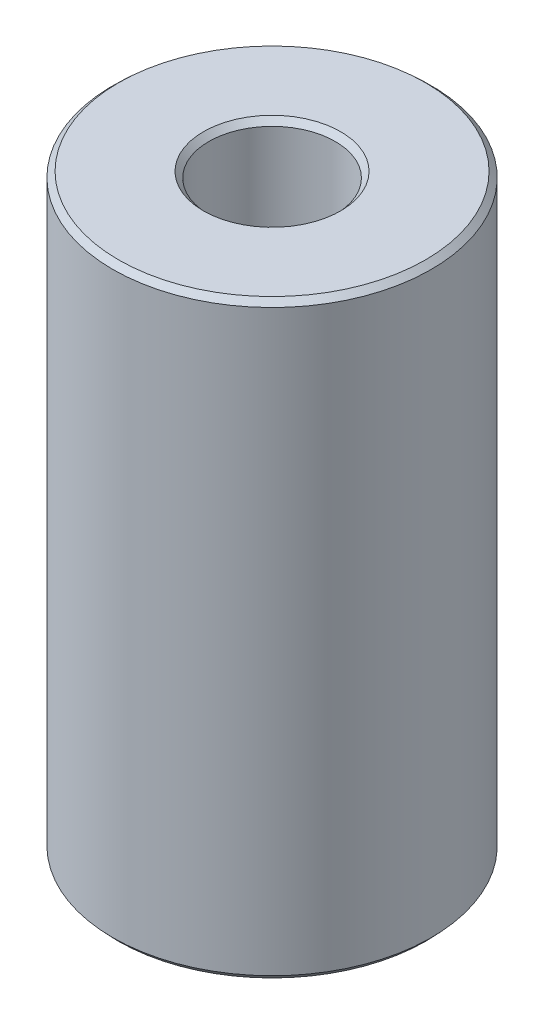
ISO-10303-21;
HEADER;
FILE_DESCRIPTION(('STEP AP214'),'2;1');
FILE_NAME('part.step','',(''),(''),'','','');
FILE_SCHEMA(('AUTOMOTIVE_DESIGN { 1 0 10303 214 1 1 1 1 }'));
ENDSEC;
DATA;
#1=APPLICATION_CONTEXT('core data for automotive mechanical design processes');
#2=APPLICATION_PROTOCOL_DEFINITION('international standard','automotive_design',2000,#1);
#3=PRODUCT_CONTEXT('',#1,'mechanical');
#4=PRODUCT('Part','Part','',(#3));
#5=PRODUCT_RELATED_PRODUCT_CATEGORY('part','',(#4));
#6=PRODUCT_DEFINITION_FORMATION('','',#4);
#7=PRODUCT_DEFINITION_CONTEXT('part definition',#1,'design');
#8=PRODUCT_DEFINITION('design','',#6,#7);
#9=PRODUCT_DEFINITION_SHAPE('','',#8);
#10=(LENGTH_UNIT() NAMED_UNIT(*) SI_UNIT(.MILLI.,.METRE.));
#11=(NAMED_UNIT(*) PLANE_ANGLE_UNIT() SI_UNIT($,.RADIAN.));
#12=(NAMED_UNIT(*) SI_UNIT($,.STERADIAN.) SOLID_ANGLE_UNIT());
#13=UNCERTAINTY_MEASURE_WITH_UNIT(LENGTH_MEASURE(1.E-05),#10,'distance_accuracy_value','');
#14=(GEOMETRIC_REPRESENTATION_CONTEXT(3) GLOBAL_UNCERTAINTY_ASSIGNED_CONTEXT((#13)) GLOBAL_UNIT_ASSIGNED_CONTEXT((#10,
#11,#12)) REPRESENTATION_CONTEXT('',''));
#15=CARTESIAN_POINT('',(0.,0.,0.));
#16=DIRECTION('',(0.,0.,1.));
#17=DIRECTION('',(1.,0.,0.));
#18=AXIS2_PLACEMENT_3D('',#15,#16,#17);
#19=CARTESIAN_POINT('',(0.,55.5727695156679,0.));
#20=DIRECTION('',(0.,-1.,0.));
#21=DIRECTION('',(0.,0.,-1.));
#22=AXIS2_PLACEMENT_3D('',#19,#20,#21);
#23=CYLINDRICAL_SURFACE('',#22,15.);
#24=CARTESIAN_POINT('',(0.,0.543249397855397,0.));
#25=DIRECTION('',(0.,1.,0.));
#26=DIRECTION('',(0.,0.,1.));
#27=AXIS2_PLACEMENT_3D('',#24,#25,#26);
#28=CIRCLE('',#27,15.);
#29=CARTESIAN_POINT('',(0.,0.543249397855397,15.));
#30=VERTEX_POINT('',#29);
#31=EDGE_CURVE('E10',#30,#30,#28,.T.);
#32=ORIENTED_EDGE('',*,*,#31,.T.);
#33=EDGE_LOOP('',(#32));
#34=FACE_BOUND('',#33,.T.);
#35=CARTESIAN_POINT('',(0.,55.0635372144395,0.));
#36=DIRECTION('',(0.,1.,0.));
#37=DIRECTION('',(0.,0.,1.));
#38=AXIS2_PLACEMENT_3D('',#35,#36,#37);
#39=CIRCLE('',#38,15.);
#40=CARTESIAN_POINT('',(0.,55.0635372144395,15.));
#41=VERTEX_POINT('',#40);
#42=EDGE_CURVE('E50',#41,#41,#39,.F.);
#43=ORIENTED_EDGE('',*,*,#42,.T.);
#44=EDGE_LOOP('',(#43));
#45=FACE_BOUND('',#44,.T.);
#46=ADVANCED_FACE('F39',(#34,#45),#23,.T.);
#47=CARTESIAN_POINT('',(0.,55.5727695156679,0.));
#48=DIRECTION('',(0.,1.,0.));
#49=DIRECTION('',(0.,0.,1.));
#50=AXIS2_PLACEMENT_3D('',#47,#48,#49);
#51=PLANE('',#50);
#52=CARTESIAN_POINT('',(0.,55.5727695156679,0.));
#53=DIRECTION('',(0.,1.,0.));
#54=DIRECTION('',(0.,0.,1.));
#55=AXIS2_PLACEMENT_3D('',#52,#53,#54);
#56=CIRCLE('',#55,6.46547847952785);
#57=CARTESIAN_POINT('',(0.,55.5727695156679,6.46547847952785));
#58=VERTEX_POINT('',#57);
#59=EDGE_CURVE('E58',#58,#58,#56,.F.);
#60=ORIENTED_EDGE('',*,*,#59,.T.);
#61=EDGE_LOOP('',(#60));
#62=FACE_BOUND('',#61,.T.);
#63=CARTESIAN_POINT('',(0.,55.5727695156679,0.));
#64=DIRECTION('',(0.,1.,0.));
#65=DIRECTION('',(0.,0.,1.));
#66=AXIS2_PLACEMENT_3D('',#63,#64,#65);
#67=CIRCLE('',#66,14.4567506021446);
#68=CARTESIAN_POINT('',(0.,55.5727695156679,14.4567506021446));
#69=VERTEX_POINT('',#68);
#70=EDGE_CURVE('E61',#69,#69,#67,.T.);
#71=ORIENTED_EDGE('',*,*,#70,.T.);
#72=EDGE_LOOP('',(#71));
#73=FACE_BOUND('',#72,.T.);
#74=ADVANCED_FACE('F88',(#62,#73),#51,.T.);
#75=CARTESIAN_POINT('',(0.,0.,0.));
#76=DIRECTION('',(0.,1.,0.));
#77=DIRECTION('',(0.,0.,1.));
#78=AXIS2_PLACEMENT_3D('',#75,#76,#77);
#79=PLANE('',#78);
#80=CARTESIAN_POINT('',(0.,0.,0.));
#81=DIRECTION('',(0.,1.,0.));
#82=DIRECTION('',(0.,0.,1.));
#83=AXIS2_PLACEMENT_3D('',#80,#81,#82);
#84=CIRCLE('',#83,6.49949557615495);
#85=CARTESIAN_POINT('',(0.,0.,6.49949557615495));
#86=VERTEX_POINT('',#85);
#87=EDGE_CURVE('E51',#86,#86,#84,.T.);
#88=ORIENTED_EDGE('',*,*,#87,.T.);
#89=EDGE_LOOP('',(#88));
#90=FACE_BOUND('',#89,.T.);
#91=CARTESIAN_POINT('',(0.,0.,0.));
#92=DIRECTION('',(0.,1.,0.));
#93=DIRECTION('',(0.,0.,1.));
#94=AXIS2_PLACEMENT_3D('',#91,#92,#93);
#95=CIRCLE('',#94,14.4907676987717);
#96=CARTESIAN_POINT('',(0.,0.,14.4907676987717));
#97=VERTEX_POINT('',#96);
#98=EDGE_CURVE('E54',#97,#97,#95,.F.);
#99=ORIENTED_EDGE('',*,*,#98,.T.);
#100=EDGE_LOOP('',(#99));
#101=FACE_BOUND('',#100,.T.);
#102=ADVANCED_FACE('F83',(#90,#101),#79,.F.);
#103=CARTESIAN_POINT('',(0.,55.5727695156679,0.));
#104=DIRECTION('',(0.,-1.,0.));
#105=DIRECTION('',(0.,0.,-1.));
#106=AXIS2_PLACEMENT_3D('',#103,#104,#105);
#107=CYLINDRICAL_SURFACE('',#106,5.95624617829956);
#108=CARTESIAN_POINT('',(0.,55.0295201178125,0.));
#109=DIRECTION('',(0.,1.,0.));
#110=DIRECTION('',(0.,0.,1.));
#111=AXIS2_PLACEMENT_3D('',#108,#109,#110);
#112=CIRCLE('',#111,5.95624617829956);
#113=CARTESIAN_POINT('',(0.,55.0295201178125,5.95624617829956));
#114=VERTEX_POINT('',#113);
#115=EDGE_CURVE('E67',#114,#114,#112,.T.);
#116=ORIENTED_EDGE('',*,*,#115,.T.);
#117=EDGE_LOOP('',(#116));
#118=FACE_BOUND('',#117,.T.);
#119=CARTESIAN_POINT('',(0.,0.509232301228312,0.));
#120=DIRECTION('',(0.,1.,0.));
#121=DIRECTION('',(0.,0.,1.));
#122=AXIS2_PLACEMENT_3D('',#119,#120,#121);
#123=CIRCLE('',#122,5.95624617829956);
#124=CARTESIAN_POINT('',(0.,0.509232301228312,5.95624617829956));
#125=VERTEX_POINT('',#124);
#126=EDGE_CURVE('E69',#125,#125,#123,.F.);
#127=ORIENTED_EDGE('',*,*,#126,.T.);
#128=EDGE_LOOP('',(#127));
#129=FACE_BOUND('',#128,.T.);
#130=ADVANCED_FACE('F71',(#118,#129),#107,.F.);
#131=CARTESIAN_POINT('',(0.,55.0295201178125,0.));
#132=DIRECTION('',(0.,1.,0.));
#133=DIRECTION('',(0.,0.,1.));
#134=AXIS2_PLACEMENT_3D('',#131,#132,#133);
#135=CONICAL_SURFACE('',#134,5.95624617829956,0.753088567037223);
#136=ORIENTED_EDGE('',*,*,#59,.F.);
#137=EDGE_LOOP('',(#136));
#138=FACE_BOUND('',#137,.T.);
#139=ORIENTED_EDGE('',*,*,#115,.F.);
#140=EDGE_LOOP('',(#139));
#141=FACE_BOUND('',#140,.T.);
#142=ADVANCED_FACE('F77',(#138,#141),#135,.F.);
#143=CARTESIAN_POINT('',(0.,0.,0.));
#144=DIRECTION('',(0.,-1.,0.));
#145=DIRECTION('',(0.,0.,-1.));
#146=AXIS2_PLACEMENT_3D('',#143,#144,#145);
#147=CONICAL_SURFACE('',#146,6.49949557615495,0.81770775975767);
#148=ORIENTED_EDGE('',*,*,#126,.F.);
#149=EDGE_LOOP('',(#148));
#150=FACE_BOUND('',#149,.T.);
#151=ORIENTED_EDGE('',*,*,#87,.F.);
#152=EDGE_LOOP('',(#151));
#153=FACE_BOUND('',#152,.T.);
#154=ADVANCED_FACE('F73',(#150,#153),#147,.F.);
#155=CARTESIAN_POINT('',(0.,0.543249397855397,0.));
#156=DIRECTION('',(0.,1.,0.));
#157=DIRECTION('',(0.,0.,1.));
#158=AXIS2_PLACEMENT_3D('',#155,#156,#157);
#159=CONICAL_SURFACE('',#158,15.,0.753088567037223);
#160=ORIENTED_EDGE('',*,*,#98,.F.);
#161=EDGE_LOOP('',(#160));
#162=FACE_BOUND('',#161,.T.);
#163=ORIENTED_EDGE('',*,*,#31,.F.);
#164=EDGE_LOOP('',(#163));
#165=FACE_BOUND('',#164,.T.);
#166=ADVANCED_FACE('F76',(#162,#165),#159,.T.);
#167=CARTESIAN_POINT('',(0.,55.5727695156679,0.));
#168=DIRECTION('',(0.,-1.,0.));
#169=DIRECTION('',(0.,0.,-1.));
#170=AXIS2_PLACEMENT_3D('',#167,#168,#169);
#171=CONICAL_SURFACE('',#170,14.4567506021446,0.817707759757666);
#172=ORIENTED_EDGE('',*,*,#42,.F.);
#173=EDGE_LOOP('',(#172));
#174=FACE_BOUND('',#173,.T.);
#175=ORIENTED_EDGE('',*,*,#70,.F.);
#176=EDGE_LOOP('',(#175));
#177=FACE_BOUND('',#176,.T.);
#178=ADVANCED_FACE('F45',(#174,#177),#171,.T.);
#179=CLOSED_SHELL('',(#46,#74,#102,#130,#142,#154,#166,#178));
#180=MANIFOLD_SOLID_BREP('B2',#179);
#181=ADVANCED_BREP_SHAPE_REPRESENTATION('',(#18,#180),#14);
#182=SHAPE_DEFINITION_REPRESENTATION(#9,#181);
ENDSEC;
END-ISO-10303-21;
